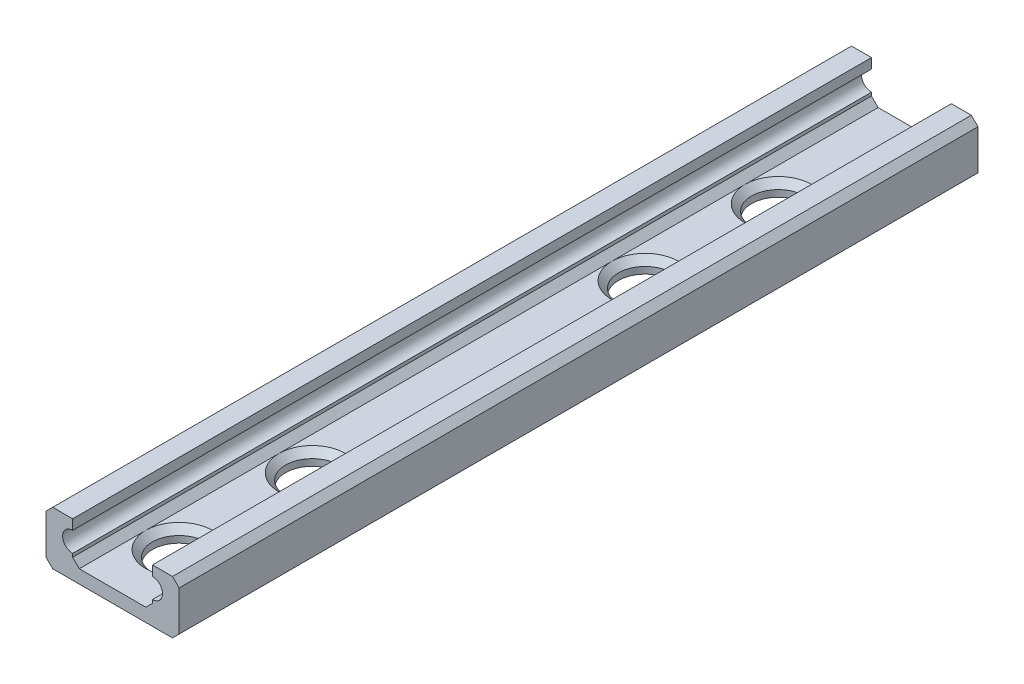
ISO-10303-21;
HEADER;
FILE_DESCRIPTION(('STEP AP214'),'2;1');
FILE_NAME('part.step','',(''),(''),'','','');
FILE_SCHEMA(('AUTOMOTIVE_DESIGN { 1 0 10303 214 1 1 1 1 }'));
ENDSEC;
DATA;
#1=APPLICATION_CONTEXT('core data for automotive mechanical design processes');
#2=APPLICATION_PROTOCOL_DEFINITION('international standard','automotive_design',2000,#1);
#3=PRODUCT_CONTEXT('',#1,'mechanical');
#4=PRODUCT('Part','Part','',(#3));
#5=PRODUCT_RELATED_PRODUCT_CATEGORY('part','',(#4));
#6=PRODUCT_DEFINITION_FORMATION('','',#4);
#7=PRODUCT_DEFINITION_CONTEXT('part definition',#1,'design');
#8=PRODUCT_DEFINITION('design','',#6,#7);
#9=PRODUCT_DEFINITION_SHAPE('','',#8);
#10=(LENGTH_UNIT() NAMED_UNIT(*) SI_UNIT(.MILLI.,.METRE.));
#11=(NAMED_UNIT(*) PLANE_ANGLE_UNIT() SI_UNIT($,.RADIAN.));
#12=(NAMED_UNIT(*) SI_UNIT($,.STERADIAN.) SOLID_ANGLE_UNIT());
#13=UNCERTAINTY_MEASURE_WITH_UNIT(LENGTH_MEASURE(1.E-05),#10,'distance_accuracy_value','');
#14=(GEOMETRIC_REPRESENTATION_CONTEXT(3) GLOBAL_UNCERTAINTY_ASSIGNED_CONTEXT((#13)) GLOBAL_UNIT_ASSIGNED_CONTEXT((#10,
#11,#12)) REPRESENTATION_CONTEXT('',''));
#15=CARTESIAN_POINT('',(0.,0.,0.));
#16=DIRECTION('',(0.,0.,1.));
#17=DIRECTION('',(1.,0.,0.));
#18=AXIS2_PLACEMENT_3D('',#15,#16,#17);
#19=CARTESIAN_POINT('',(0.,-1.,100.));
#20=DIRECTION('',(0.,-1.,0.));
#21=DIRECTION('',(0.,0.,-1.));
#22=AXIS2_PLACEMENT_3D('',#19,#20,#21);
#23=PLANE('',#22);
#24=DIRECTION('',(-1.,0.,0.));
#25=VECTOR('',#24,1.);
#26=CARTESIAN_POINT('',(0.,-1.,60.));
#27=LINE('',#26,#25);
#28=CARTESIAN_POINT('',(2.5,-1.,60.));
#29=VERTEX_POINT('',#28);
#30=CARTESIAN_POINT('',(-2.5,-1.,60.));
#31=VERTEX_POINT('',#30);
#32=EDGE_CURVE('E369',#29,#31,#27,.T.);
#33=ORIENTED_EDGE('',*,*,#32,.F.);
#34=DIRECTION('',(0.,0.,-1.));
#35=VECTOR('',#34,1.);
#36=CARTESIAN_POINT('',(2.5,-1.,100.));
#37=LINE('',#36,#35);
#38=CARTESIAN_POINT('',(2.5,-1.,55.));
#39=VERTEX_POINT('',#38);
#40=EDGE_CURVE('E320',#29,#39,#37,.T.);
#41=ORIENTED_EDGE('',*,*,#40,.T.);
#42=CARTESIAN_POINT('',(0.,-1.,55.));
#43=DIRECTION('',(0.,-1.,0.));
#44=DIRECTION('',(0.,0.,-1.));
#45=AXIS2_PLACEMENT_3D('',#42,#43,#44);
#46=CIRCLE('',#45,2.49999999999999);
#47=CARTESIAN_POINT('',(-2.5,-1.,55.));
#48=VERTEX_POINT('',#47);
#49=EDGE_CURVE('E58',#39,#48,#46,.T.);
#50=ORIENTED_EDGE('',*,*,#49,.T.);
#51=DIRECTION('',(0.,0.,1.));
#52=VECTOR('',#51,1.);
#53=CARTESIAN_POINT('',(-2.5,-1.,100.));
#54=LINE('',#53,#52);
#55=EDGE_CURVE('E300',#48,#31,#54,.T.);
#56=ORIENTED_EDGE('',*,*,#55,.T.);
#57=EDGE_LOOP('',(#33,#41,#50,#56));
#58=FACE_BOUND('',#57,.T.);
#59=ADVANCED_FACE('F36',(#58),#23,.F.);
#60=CARTESIAN_POINT('',(-3.,0.500000000000001,100.));
#61=DIRECTION('',(0.,0.,-1.));
#62=DIRECTION('',(-1.,0.,0.));
#63=AXIS2_PLACEMENT_3D('',#60,#61,#62);
#64=CYLINDRICAL_SURFACE('',#63,0.75);
#65=DIRECTION('',(0.,0.,-1.));
#66=VECTOR('',#65,1.);
#67=CARTESIAN_POINT('',(-3.,1.25,100.));
#68=LINE('',#67,#66);
#69=CARTESIAN_POINT('',(-3.,1.25,60.));
#70=VERTEX_POINT('',#69);
#71=CARTESIAN_POINT('',(-3.,1.25,0.));
#72=VERTEX_POINT('',#71);
#73=EDGE_CURVE('E318',#70,#72,#68,.T.);
#74=ORIENTED_EDGE('',*,*,#73,.F.);
#75=CARTESIAN_POINT('',(-3.,0.500000000000001,60.));
#76=DIRECTION('',(0.,0.,1.));
#77=DIRECTION('',(1.,0.,0.));
#78=AXIS2_PLACEMENT_3D('',#75,#76,#77);
#79=CIRCLE('',#78,0.75);
#80=CARTESIAN_POINT('',(-3.,-0.249999999999999,60.));
#81=VERTEX_POINT('',#80);
#82=EDGE_CURVE('E499',#70,#81,#79,.T.);
#83=ORIENTED_EDGE('',*,*,#82,.T.);
#84=DIRECTION('',(0.,0.,-1.));
#85=VECTOR('',#84,1.);
#86=CARTESIAN_POINT('',(-3.,-0.249999999999999,100.));
#87=LINE('',#86,#85);
#88=CARTESIAN_POINT('',(-3.,-0.249999999999999,0.));
#89=VERTEX_POINT('',#88);
#90=EDGE_CURVE('E424',#81,#89,#87,.T.);
#91=ORIENTED_EDGE('',*,*,#90,.T.);
#92=CARTESIAN_POINT('',(-3.,0.500000000000001,0.));
#93=DIRECTION('',(0.,0.,1.));
#94=DIRECTION('',(1.,0.,0.));
#95=AXIS2_PLACEMENT_3D('',#92,#93,#94);
#96=CIRCLE('',#95,0.75);
#97=EDGE_CURVE('E400',#72,#89,#96,.T.);
#98=ORIENTED_EDGE('',*,*,#97,.F.);
#99=EDGE_LOOP('',(#74,#83,#91,#98));
#100=FACE_BOUND('',#99,.T.);
#101=ADVANCED_FACE('F258',(#100),#64,.F.);
#102=CARTESIAN_POINT('',(-3.,0.,100.));
#103=DIRECTION('',(-1.,0.,0.));
#104=DIRECTION('',(0.,0.,1.));
#105=AXIS2_PLACEMENT_3D('',#102,#103,#104);
#106=PLANE('',#105);
#107=DIRECTION('',(0.,1.,0.));
#108=VECTOR('',#107,1.);
#109=CARTESIAN_POINT('',(-3.,0.,60.));
#110=LINE('',#109,#108);
#111=CARTESIAN_POINT('',(-3.,2.,60.));
#112=VERTEX_POINT('',#111);
#113=EDGE_CURVE('E500',#70,#112,#110,.T.);
#114=ORIENTED_EDGE('',*,*,#113,.F.);
#115=ORIENTED_EDGE('',*,*,#73,.T.);
#116=DIRECTION('',(0.,1.,0.));
#117=VECTOR('',#116,1.);
#118=CARTESIAN_POINT('',(-3.,0.,0.));
#119=LINE('',#118,#117);
#120=CARTESIAN_POINT('',(-3.,2.,0.));
#121=VERTEX_POINT('',#120);
#122=EDGE_CURVE('E403',#72,#121,#119,.T.);
#123=ORIENTED_EDGE('',*,*,#122,.T.);
#124=DIRECTION('',(0.,0.,-1.));
#125=VECTOR('',#124,1.);
#126=CARTESIAN_POINT('',(-3.,2.,100.));
#127=LINE('',#126,#125);
#128=EDGE_CURVE('E431',#112,#121,#127,.T.);
#129=ORIENTED_EDGE('',*,*,#128,.F.);
#130=EDGE_LOOP('',(#114,#115,#123,#129));
#131=FACE_BOUND('',#130,.T.);
#132=ADVANCED_FACE('F265',(#131),#106,.F.);
#133=CARTESIAN_POINT('',(0.,2.,100.));
#134=DIRECTION('',(0.,1.,0.));
#135=DIRECTION('',(0.,0.,1.));
#136=AXIS2_PLACEMENT_3D('',#133,#134,#135);
#137=PLANE('',#136);
#138=DIRECTION('',(0.,0.,1.));
#139=VECTOR('',#138,1.);
#140=CARTESIAN_POINT('',(-4.5,2.,100.));
#141=LINE('',#140,#139);
#142=CARTESIAN_POINT('',(-4.5,2.,0.));
#143=VERTEX_POINT('',#142);
#144=CARTESIAN_POINT('',(-4.5,2.,60.));
#145=VERTEX_POINT('',#144);
#146=EDGE_CURVE('E204',#143,#145,#141,.T.);
#147=ORIENTED_EDGE('',*,*,#146,.T.);
#148=DIRECTION('',(1.,0.,0.));
#149=VECTOR('',#148,1.);
#150=CARTESIAN_POINT('',(0.,2.,60.));
#151=LINE('',#150,#149);
#152=EDGE_CURVE('E51',#145,#112,#151,.T.);
#153=ORIENTED_EDGE('',*,*,#152,.T.);
#154=ORIENTED_EDGE('',*,*,#128,.T.);
#155=DIRECTION('',(1.,0.,0.));
#156=VECTOR('',#155,1.);
#157=CARTESIAN_POINT('',(0.,2.,0.));
#158=LINE('',#157,#156);
#159=EDGE_CURVE('E406',#143,#121,#158,.T.);
#160=ORIENTED_EDGE('',*,*,#159,.F.);
#161=EDGE_LOOP('',(#147,#153,#154,#160));
#162=FACE_BOUND('',#161,.T.);
#163=ADVANCED_FACE('F471',(#162),#137,.T.);
#164=CARTESIAN_POINT('',(-5.,0.,100.));
#165=DIRECTION('',(1.,0.,0.));
#166=DIRECTION('',(0.,0.,-1.));
#167=AXIS2_PLACEMENT_3D('',#164,#165,#166);
#168=PLANE('',#167);
#169=DIRECTION('',(0.,-1.,0.));
#170=VECTOR('',#169,1.);
#171=CARTESIAN_POINT('',(-5.,0.,60.));
#172=LINE('',#171,#170);
#173=CARTESIAN_POINT('',(-5.,1.5,60.));
#174=VERTEX_POINT('',#173);
#175=CARTESIAN_POINT('',(-5.,-1.5,60.));
#176=VERTEX_POINT('',#175);
#177=EDGE_CURVE('E184',#174,#176,#172,.T.);
#178=ORIENTED_EDGE('',*,*,#177,.F.);
#179=DIRECTION('',(0.,0.,-1.));
#180=VECTOR('',#179,1.);
#181=CARTESIAN_POINT('',(-5.,1.5,0.));
#182=LINE('',#181,#180);
#183=CARTESIAN_POINT('',(-5.,1.5,0.));
#184=VERTEX_POINT('',#183);
#185=EDGE_CURVE('E194',#174,#184,#182,.T.);
#186=ORIENTED_EDGE('',*,*,#185,.T.);
#187=DIRECTION('',(0.,-1.,0.));
#188=VECTOR('',#187,1.);
#189=CARTESIAN_POINT('',(-5.,0.,0.));
#190=LINE('',#189,#188);
#191=CARTESIAN_POINT('',(-5.,-1.5,0.));
#192=VERTEX_POINT('',#191);
#193=EDGE_CURVE('E410',#184,#192,#190,.T.);
#194=ORIENTED_EDGE('',*,*,#193,.T.);
#195=DIRECTION('',(0.,0.,1.));
#196=VECTOR('',#195,1.);
#197=CARTESIAN_POINT('',(-5.,-1.5,100.));
#198=LINE('',#197,#196);
#199=EDGE_CURVE('E197',#192,#176,#198,.T.);
#200=ORIENTED_EDGE('',*,*,#199,.T.);
#201=EDGE_LOOP('',(#178,#186,#194,#200));
#202=FACE_BOUND('',#201,.T.);
#203=ADVANCED_FACE('F192',(#202),#168,.F.);
#204=CARTESIAN_POINT('',(0.,-2.,100.));
#205=DIRECTION('',(0.,1.,0.));
#206=DIRECTION('',(0.,0.,1.));
#207=AXIS2_PLACEMENT_3D('',#204,#205,#206);
#208=PLANE('',#207);
#209=CARTESIAN_POINT('',(0.,-2.,20.));
#210=DIRECTION('',(0.,1.,0.));
#211=DIRECTION('',(0.,0.,1.));
#212=AXIS2_PLACEMENT_3D('',#209,#210,#211);
#213=CIRCLE('',#212,2.);
#214=CARTESIAN_POINT('',(0.,-2.,22.));
#215=VERTEX_POINT('',#214);
#216=EDGE_CURVE('E394',#215,#215,#213,.T.);
#217=ORIENTED_EDGE('',*,*,#216,.T.);
#218=EDGE_LOOP('',(#217));
#219=FACE_BOUND('',#218,.T.);
#220=CARTESIAN_POINT('',(0.,-2.,10.));
#221=DIRECTION('',(0.,1.,0.));
#222=DIRECTION('',(0.,0.,1.));
#223=AXIS2_PLACEMENT_3D('',#220,#221,#222);
#224=CIRCLE('',#223,2.);
#225=CARTESIAN_POINT('',(0.,-2.,12.));
#226=VERTEX_POINT('',#225);
#227=EDGE_CURVE('E397',#226,#226,#224,.T.);
#228=ORIENTED_EDGE('',*,*,#227,.T.);
#229=EDGE_LOOP('',(#228));
#230=FACE_BOUND('',#229,.T.);
#231=CARTESIAN_POINT('',(0.,-2.,55.));
#232=DIRECTION('',(0.,1.,0.));
#233=DIRECTION('',(0.,0.,1.));
#234=AXIS2_PLACEMENT_3D('',#231,#232,#233);
#235=CIRCLE('',#234,2.);
#236=CARTESIAN_POINT('',(0.,-2.,57.));
#237=VERTEX_POINT('',#236);
#238=EDGE_CURVE('E388',#237,#237,#235,.T.);
#239=ORIENTED_EDGE('',*,*,#238,.T.);
#240=EDGE_LOOP('',(#239));
#241=FACE_BOUND('',#240,.T.);
#242=CARTESIAN_POINT('',(0.,-2.,45.));
#243=DIRECTION('',(0.,1.,0.));
#244=DIRECTION('',(0.,0.,1.));
#245=AXIS2_PLACEMENT_3D('',#242,#243,#244);
#246=CIRCLE('',#245,2.);
#247=CARTESIAN_POINT('',(0.,-2.,47.));
#248=VERTEX_POINT('',#247);
#249=EDGE_CURVE('E391',#248,#248,#246,.T.);
#250=ORIENTED_EDGE('',*,*,#249,.T.);
#251=EDGE_LOOP('',(#250));
#252=FACE_BOUND('',#251,.T.);
#253=DIRECTION('',(1.,0.,0.));
#254=VECTOR('',#253,1.);
#255=CARTESIAN_POINT('',(0.,-2.,60.));
#256=LINE('',#255,#254);
#257=CARTESIAN_POINT('',(-4.5,-2.,60.));
#258=VERTEX_POINT('',#257);
#259=CARTESIAN_POINT('',(4.5,-2.,60.));
#260=VERTEX_POINT('',#259);
#261=EDGE_CURVE('E348',#258,#260,#256,.T.);
#262=ORIENTED_EDGE('',*,*,#261,.F.);
#263=DIRECTION('',(0.,0.,-1.));
#264=VECTOR('',#263,1.);
#265=CARTESIAN_POINT('',(-4.5,-2.,100.));
#266=LINE('',#265,#264);
#267=CARTESIAN_POINT('',(-4.5,-2.,0.));
#268=VERTEX_POINT('',#267);
#269=EDGE_CURVE('E341',#258,#268,#266,.T.);
#270=ORIENTED_EDGE('',*,*,#269,.T.);
#271=DIRECTION('',(1.,0.,0.));
#272=VECTOR('',#271,1.);
#273=CARTESIAN_POINT('',(0.,-2.,0.));
#274=LINE('',#273,#272);
#275=CARTESIAN_POINT('',(4.5,-2.,0.));
#276=VERTEX_POINT('',#275);
#277=EDGE_CURVE('E351',#268,#276,#274,.T.);
#278=ORIENTED_EDGE('',*,*,#277,.T.);
#279=DIRECTION('',(0.,0.,1.));
#280=VECTOR('',#279,1.);
#281=CARTESIAN_POINT('',(4.5,-2.,100.));
#282=LINE('',#281,#280);
#283=EDGE_CURVE('E206',#276,#260,#282,.T.);
#284=ORIENTED_EDGE('',*,*,#283,.T.);
#285=EDGE_LOOP('',(#262,#270,#278,#284));
#286=FACE_BOUND('',#285,.T.);
#287=ADVANCED_FACE('F347',(#219,#230,#241,#252,#286),#208,.F.);
#288=CARTESIAN_POINT('',(5.,0.,100.));
#289=DIRECTION('',(1.,0.,0.));
#290=DIRECTION('',(0.,0.,-1.));
#291=AXIS2_PLACEMENT_3D('',#288,#289,#290);
#292=PLANE('',#291);
#293=DIRECTION('',(0.,0.,1.));
#294=VECTOR('',#293,1.);
#295=CARTESIAN_POINT('',(5.,1.5,100.));
#296=LINE('',#295,#294);
#297=CARTESIAN_POINT('',(5.,1.5,0.));
#298=VERTEX_POINT('',#297);
#299=CARTESIAN_POINT('',(5.,1.5,60.));
#300=VERTEX_POINT('',#299);
#301=EDGE_CURVE('E329',#298,#300,#296,.T.);
#302=ORIENTED_EDGE('',*,*,#301,.T.);
#303=DIRECTION('',(0.,-1.,0.));
#304=VECTOR('',#303,1.);
#305=CARTESIAN_POINT('',(5.,0.,60.));
#306=LINE('',#305,#304);
#307=CARTESIAN_POINT('',(5.,-1.5,60.));
#308=VERTEX_POINT('',#307);
#309=EDGE_CURVE('E362',#300,#308,#306,.T.);
#310=ORIENTED_EDGE('',*,*,#309,.T.);
#311=DIRECTION('',(0.,0.,-1.));
#312=VECTOR('',#311,1.);
#313=CARTESIAN_POINT('',(5.,-1.5,0.));
#314=LINE('',#313,#312);
#315=CARTESIAN_POINT('',(5.,-1.5,0.));
#316=VERTEX_POINT('',#315);
#317=EDGE_CURVE('E332',#308,#316,#314,.T.);
#318=ORIENTED_EDGE('',*,*,#317,.T.);
#319=DIRECTION('',(0.,-1.,0.));
#320=VECTOR('',#319,1.);
#321=CARTESIAN_POINT('',(5.,0.,0.));
#322=LINE('',#321,#320);
#323=EDGE_CURVE('E414',#298,#316,#322,.T.);
#324=ORIENTED_EDGE('',*,*,#323,.F.);
#325=EDGE_LOOP('',(#302,#310,#318,#324));
#326=FACE_BOUND('',#325,.T.);
#327=ADVANCED_FACE('F454',(#326),#292,.T.);
#328=DIRECTION('',(0.,0.,-1.));
#329=VECTOR('',#328,1.);
#330=CARTESIAN_POINT('',(3.,2.,100.));
#331=LINE('',#330,#329);
#332=CARTESIAN_POINT('',(3.,2.,60.));
#333=VERTEX_POINT('',#332);
#334=CARTESIAN_POINT('',(3.,2.,0.));
#335=VERTEX_POINT('',#334);
#336=EDGE_CURVE('E430',#333,#335,#331,.T.);
#337=ORIENTED_EDGE('',*,*,#336,.F.);
#338=DIRECTION('',(1.,0.,0.));
#339=VECTOR('',#338,1.);
#340=CARTESIAN_POINT('',(0.,2.,60.));
#341=LINE('',#340,#339);
#342=CARTESIAN_POINT('',(4.5,2.,60.));
#343=VERTEX_POINT('',#342);
#344=EDGE_CURVE('E385',#333,#343,#341,.T.);
#345=ORIENTED_EDGE('',*,*,#344,.T.);
#346=DIRECTION('',(0.,0.,-1.));
#347=VECTOR('',#346,1.);
#348=CARTESIAN_POINT('',(4.5,2.,100.));
#349=LINE('',#348,#347);
#350=CARTESIAN_POINT('',(4.5,2.,0.));
#351=VERTEX_POINT('',#350);
#352=EDGE_CURVE('E202',#343,#351,#349,.T.);
#353=ORIENTED_EDGE('',*,*,#352,.T.);
#354=EDGE_CURVE('E411',#335,#351,#158,.T.);
#355=ORIENTED_EDGE('',*,*,#354,.F.);
#356=EDGE_LOOP('',(#337,#345,#353,#355));
#357=FACE_BOUND('',#356,.T.);
#358=ADVANCED_FACE('F477',(#357),#137,.T.);
#359=CARTESIAN_POINT('',(3.,0.,100.));
#360=DIRECTION('',(-1.,0.,0.));
#361=DIRECTION('',(0.,0.,1.));
#362=AXIS2_PLACEMENT_3D('',#359,#360,#361);
#363=PLANE('',#362);
#364=DIRECTION('',(0.,0.,-1.));
#365=VECTOR('',#364,1.);
#366=CARTESIAN_POINT('',(3.,1.25,100.));
#367=LINE('',#366,#365);
#368=CARTESIAN_POINT('',(3.,1.25,60.));
#369=VERTEX_POINT('',#368);
#370=CARTESIAN_POINT('',(3.,1.25,0.));
#371=VERTEX_POINT('',#370);
#372=EDGE_CURVE('E428',#369,#371,#367,.T.);
#373=ORIENTED_EDGE('',*,*,#372,.F.);
#374=DIRECTION('',(0.,1.,0.));
#375=VECTOR('',#374,1.);
#376=CARTESIAN_POINT('',(3.,0.,60.));
#377=LINE('',#376,#375);
#378=EDGE_CURVE('E382',#369,#333,#377,.T.);
#379=ORIENTED_EDGE('',*,*,#378,.T.);
#380=ORIENTED_EDGE('',*,*,#336,.T.);
#381=DIRECTION('',(0.,1.,0.));
#382=VECTOR('',#381,1.);
#383=CARTESIAN_POINT('',(3.,0.,0.));
#384=LINE('',#383,#382);
#385=EDGE_CURVE('E416',#371,#335,#384,.T.);
#386=ORIENTED_EDGE('',*,*,#385,.F.);
#387=EDGE_LOOP('',(#373,#379,#380,#386));
#388=FACE_BOUND('',#387,.T.);
#389=ADVANCED_FACE('F490',(#388),#363,.T.);
#390=CARTESIAN_POINT('',(3.,0.500000000000001,100.));
#391=DIRECTION('',(0.,0.,-1.));
#392=DIRECTION('',(-1.,0.,0.));
#393=AXIS2_PLACEMENT_3D('',#390,#391,#392);
#394=CYLINDRICAL_SURFACE('',#393,0.75);
#395=DIRECTION('',(0.,0.,-1.));
#396=VECTOR('',#395,1.);
#397=CARTESIAN_POINT('',(3.,-0.25,100.));
#398=LINE('',#397,#396);
#399=CARTESIAN_POINT('',(3.,-0.25,60.));
#400=VERTEX_POINT('',#399);
#401=CARTESIAN_POINT('',(3.,-0.25,0.));
#402=VERTEX_POINT('',#401);
#403=EDGE_CURVE('E426',#400,#402,#398,.T.);
#404=ORIENTED_EDGE('',*,*,#403,.F.);
#405=CARTESIAN_POINT('',(3.,0.500000000000001,60.));
#406=DIRECTION('',(0.,0.,1.));
#407=DIRECTION('',(1.,0.,0.));
#408=AXIS2_PLACEMENT_3D('',#405,#406,#407);
#409=CIRCLE('',#408,0.75);
#410=EDGE_CURVE('E379',#400,#369,#409,.T.);
#411=ORIENTED_EDGE('',*,*,#410,.T.);
#412=ORIENTED_EDGE('',*,*,#372,.T.);
#413=CARTESIAN_POINT('',(3.,0.500000000000001,0.));
#414=DIRECTION('',(0.,0.,1.));
#415=DIRECTION('',(1.,0.,0.));
#416=AXIS2_PLACEMENT_3D('',#413,#414,#415);
#417=CIRCLE('',#416,0.75);
#418=EDGE_CURVE('E419',#402,#371,#417,.T.);
#419=ORIENTED_EDGE('',*,*,#418,.F.);
#420=EDGE_LOOP('',(#404,#411,#412,#419));
#421=FACE_BOUND('',#420,.T.);
#422=ADVANCED_FACE('F488',(#421),#394,.F.);
#423=DIRECTION('',(0.,0.,1.));
#424=VECTOR('',#423,1.);
#425=CARTESIAN_POINT('',(3.,-0.499999999999999,100.));
#426=LINE('',#425,#424);
#427=CARTESIAN_POINT('',(3.,-0.499999999999999,0.));
#428=VERTEX_POINT('',#427);
#429=CARTESIAN_POINT('',(3.,-0.499999999999999,60.));
#430=VERTEX_POINT('',#429);
#431=EDGE_CURVE('E322',#428,#430,#426,.T.);
#432=ORIENTED_EDGE('',*,*,#431,.T.);
#433=DIRECTION('',(0.,1.,0.));
#434=VECTOR('',#433,1.);
#435=CARTESIAN_POINT('',(3.,0.,60.));
#436=LINE('',#435,#434);
#437=EDGE_CURVE('E376',#430,#400,#436,.T.);
#438=ORIENTED_EDGE('',*,*,#437,.T.);
#439=ORIENTED_EDGE('',*,*,#403,.T.);
#440=EDGE_CURVE('E420',#428,#402,#384,.T.);
#441=ORIENTED_EDGE('',*,*,#440,.F.);
#442=EDGE_LOOP('',(#432,#438,#439,#441));
#443=FACE_BOUND('',#442,.T.);
#444=ADVANCED_FACE('F480',(#443),#363,.T.);
#445=DIRECTION('',(0.,1.,0.));
#446=VECTOR('',#445,1.);
#447=CARTESIAN_POINT('',(-3.,0.,60.));
#448=LINE('',#447,#446);
#449=CARTESIAN_POINT('',(-3.,-0.499999999999999,60.));
#450=VERTEX_POINT('',#449);
#451=EDGE_CURVE('E364',#450,#81,#448,.T.);
#452=ORIENTED_EDGE('',*,*,#451,.F.);
#453=DIRECTION('',(0.,0.,-1.));
#454=VECTOR('',#453,1.);
#455=CARTESIAN_POINT('',(-3.,-0.499999999999999,0.));
#456=LINE('',#455,#454);
#457=CARTESIAN_POINT('',(-3.,-0.499999999999999,0.));
#458=VERTEX_POINT('',#457);
#459=EDGE_CURVE('E327',#450,#458,#456,.T.);
#460=ORIENTED_EDGE('',*,*,#459,.T.);
#461=EDGE_CURVE('E407',#458,#89,#119,.T.);
#462=ORIENTED_EDGE('',*,*,#461,.T.);
#463=ORIENTED_EDGE('',*,*,#90,.F.);
#464=EDGE_LOOP('',(#452,#460,#462,#463));
#465=FACE_BOUND('',#464,.T.);
#466=ADVANCED_FACE('F472',(#465),#106,.F.);
#467=CARTESIAN_POINT('',(2.5,-1.,100.));
#468=DIRECTION('',(0.707106781186547,-0.707106781186547,0.));
#469=DIRECTION('',(0.,0.,-1.));
#470=AXIS2_PLACEMENT_3D('',#467,#468,#469);
#471=PLANE('',#470);
#472=DIRECTION('',(-0.707106781186548,-0.707106781186548,0.));
#473=VECTOR('',#472,1.);
#474=CARTESIAN_POINT('',(2.5,-1.,60.));
#475=LINE('',#474,#473);
#476=EDGE_CURVE('E374',#430,#29,#475,.T.);
#477=ORIENTED_EDGE('',*,*,#476,.F.);
#478=ORIENTED_EDGE('',*,*,#431,.F.);
#479=DIRECTION('',(0.707106781186548,0.707106781186548,0.));
#480=VECTOR('',#479,1.);
#481=CARTESIAN_POINT('',(1.75,-1.75,0.));
#482=LINE('',#481,#480);
#483=CARTESIAN_POINT('',(2.5,-1.,0.));
#484=VERTEX_POINT('',#483);
#485=EDGE_CURVE('E211',#484,#428,#482,.T.);
#486=ORIENTED_EDGE('',*,*,#485,.F.);
#487=CARTESIAN_POINT('',(2.5,-1.,10.));
#488=VERTEX_POINT('',#487);
#489=EDGE_CURVE('E297',#488,#484,#37,.T.);
#490=ORIENTED_EDGE('',*,*,#489,.F.);
#491=CARTESIAN_POINT('',(2.5,-1.,20.));
#492=VERTEX_POINT('',#491);
#493=EDGE_CURVE('E308',#492,#488,#37,.T.);
#494=ORIENTED_EDGE('',*,*,#493,.F.);
#495=CARTESIAN_POINT('',(2.5,-1.,45.));
#496=VERTEX_POINT('',#495);
#497=EDGE_CURVE('E324',#496,#492,#37,.T.);
#498=ORIENTED_EDGE('',*,*,#497,.F.);
#499=EDGE_CURVE('E323',#39,#496,#37,.T.);
#500=ORIENTED_EDGE('',*,*,#499,.F.);
#501=ORIENTED_EDGE('',*,*,#40,.F.);
#502=EDGE_LOOP('',(#477,#478,#486,#490,#494,#498,#500,#501));
#503=FACE_BOUND('',#502,.T.);
#504=ADVANCED_FACE('F479',(#503),#471,.F.);
#505=CARTESIAN_POINT('',(-3.,-0.499999999999999,100.));
#506=DIRECTION('',(0.707106781186547,0.707106781186547,0.));
#507=DIRECTION('',(0.,0.,1.));
#508=AXIS2_PLACEMENT_3D('',#505,#506,#507);
#509=PLANE('',#508);
#510=DIRECTION('',(0.707106781186548,-0.707106781186548,0.));
#511=VECTOR('',#510,1.);
#512=CARTESIAN_POINT('',(-3.,-0.499999999999999,60.));
#513=LINE('',#512,#511);
#514=EDGE_CURVE('E360',#31,#450,#513,.F.);
#515=ORIENTED_EDGE('',*,*,#514,.F.);
#516=ORIENTED_EDGE('',*,*,#55,.F.);
#517=CARTESIAN_POINT('',(-2.5,-1.,45.));
#518=VERTEX_POINT('',#517);
#519=EDGE_CURVE('E315',#518,#48,#54,.T.);
#520=ORIENTED_EDGE('',*,*,#519,.F.);
#521=CARTESIAN_POINT('',(-2.5,-1.,20.));
#522=VERTEX_POINT('',#521);
#523=EDGE_CURVE('E314',#522,#518,#54,.T.);
#524=ORIENTED_EDGE('',*,*,#523,.F.);
#525=CARTESIAN_POINT('',(-2.5,-1.,10.));
#526=VERTEX_POINT('',#525);
#527=EDGE_CURVE('E298',#526,#522,#54,.T.);
#528=ORIENTED_EDGE('',*,*,#527,.F.);
#529=CARTESIAN_POINT('',(-2.5,-1.,0.));
#530=VERTEX_POINT('',#529);
#531=EDGE_CURVE('E289',#530,#526,#54,.T.);
#532=ORIENTED_EDGE('',*,*,#531,.F.);
#533=DIRECTION('',(-0.707106781186548,0.707106781186548,0.));
#534=VECTOR('',#533,1.);
#535=CARTESIAN_POINT('',(-1.75,-1.75,0.));
#536=LINE('',#535,#534);
#537=EDGE_CURVE('E213',#458,#530,#536,.F.);
#538=ORIENTED_EDGE('',*,*,#537,.F.);
#539=ORIENTED_EDGE('',*,*,#459,.F.);
#540=EDGE_LOOP('',(#515,#516,#520,#524,#528,#532,#538,#539));
#541=FACE_BOUND('',#540,.T.);
#542=ADVANCED_FACE('F311',(#541),#509,.T.);
#543=CARTESIAN_POINT('',(5.,-1.5,100.));
#544=DIRECTION('',(0.707106781186547,-0.707106781186547,0.));
#545=DIRECTION('',(0.,0.,1.));
#546=AXIS2_PLACEMENT_3D('',#543,#544,#545);
#547=PLANE('',#546);
#548=ORIENTED_EDGE('',*,*,#317,.F.);
#549=DIRECTION('',(-0.707106781186548,-0.707106781186548,0.));
#550=VECTOR('',#549,1.);
#551=CARTESIAN_POINT('',(5.,-1.5,60.));
#552=LINE('',#551,#550);
#553=EDGE_CURVE('E358',#308,#260,#552,.T.);
#554=ORIENTED_EDGE('',*,*,#553,.T.);
#555=ORIENTED_EDGE('',*,*,#283,.F.);
#556=DIRECTION('',(-0.707106781186548,-0.707106781186548,0.));
#557=VECTOR('',#556,1.);
#558=CARTESIAN_POINT('',(5.,-1.5,0.));
#559=LINE('',#558,#557);
#560=EDGE_CURVE('E339',#316,#276,#559,.T.);
#561=ORIENTED_EDGE('',*,*,#560,.F.);
#562=EDGE_LOOP('',(#548,#554,#555,#561));
#563=FACE_BOUND('',#562,.T.);
#564=ADVANCED_FACE('F356',(#563),#547,.T.);
#565=CARTESIAN_POINT('',(4.5,2.,100.));
#566=DIRECTION('',(-0.707106781186547,-0.707106781186547,0.));
#567=DIRECTION('',(0.,0.,-1.));
#568=AXIS2_PLACEMENT_3D('',#565,#566,#567);
#569=PLANE('',#568);
#570=ORIENTED_EDGE('',*,*,#352,.F.);
#571=DIRECTION('',(-0.707106781186548,0.707106781186548,0.));
#572=VECTOR('',#571,1.);
#573=CARTESIAN_POINT('',(4.5,2.,60.));
#574=LINE('',#573,#572);
#575=EDGE_CURVE('E371',#343,#300,#574,.F.);
#576=ORIENTED_EDGE('',*,*,#575,.T.);
#577=ORIENTED_EDGE('',*,*,#301,.F.);
#578=DIRECTION('',(-0.707106781186548,0.707106781186548,0.));
#579=VECTOR('',#578,1.);
#580=CARTESIAN_POINT('',(4.5,2.,0.));
#581=LINE('',#580,#579);
#582=EDGE_CURVE('E337',#351,#298,#581,.F.);
#583=ORIENTED_EDGE('',*,*,#582,.F.);
#584=EDGE_LOOP('',(#570,#576,#577,#583));
#585=FACE_BOUND('',#584,.T.);
#586=ADVANCED_FACE('F515',(#585),#569,.F.);
#587=CARTESIAN_POINT('',(-4.5,-2.,100.));
#588=DIRECTION('',(0.707106781186547,0.707106781186547,0.));
#589=DIRECTION('',(0.,0.,-1.));
#590=AXIS2_PLACEMENT_3D('',#587,#588,#589);
#591=PLANE('',#590);
#592=ORIENTED_EDGE('',*,*,#269,.F.);
#593=DIRECTION('',(0.707106781186548,-0.707106781186548,0.));
#594=VECTOR('',#593,1.);
#595=CARTESIAN_POINT('',(-4.5,-2.,60.));
#596=LINE('',#595,#594);
#597=EDGE_CURVE('E496',#258,#176,#596,.F.);
#598=ORIENTED_EDGE('',*,*,#597,.T.);
#599=ORIENTED_EDGE('',*,*,#199,.F.);
#600=DIRECTION('',(0.707106781186548,-0.707106781186548,0.));
#601=VECTOR('',#600,1.);
#602=CARTESIAN_POINT('',(-4.5,-2.,0.));
#603=LINE('',#602,#601);
#604=EDGE_CURVE('E335',#268,#192,#603,.F.);
#605=ORIENTED_EDGE('',*,*,#604,.F.);
#606=EDGE_LOOP('',(#592,#598,#599,#605));
#607=FACE_BOUND('',#606,.T.);
#608=ADVANCED_FACE('F507',(#607),#591,.F.);
#609=CARTESIAN_POINT('',(-5.,1.5,100.));
#610=DIRECTION('',(-0.707106781186547,0.707106781186547,0.));
#611=DIRECTION('',(0.,0.,1.));
#612=AXIS2_PLACEMENT_3D('',#609,#610,#611);
#613=PLANE('',#612);
#614=ORIENTED_EDGE('',*,*,#185,.F.);
#615=DIRECTION('',(0.707106781186548,0.707106781186548,0.));
#616=VECTOR('',#615,1.);
#617=CARTESIAN_POINT('',(-5.,1.5,60.));
#618=LINE('',#617,#616);
#619=EDGE_CURVE('E11',#174,#145,#618,.T.);
#620=ORIENTED_EDGE('',*,*,#619,.T.);
#621=ORIENTED_EDGE('',*,*,#146,.F.);
#622=DIRECTION('',(0.707106781186548,0.707106781186548,0.));
#623=VECTOR('',#622,1.);
#624=CARTESIAN_POINT('',(-5.,1.5,0.));
#625=LINE('',#624,#623);
#626=EDGE_CURVE('E200',#184,#143,#625,.T.);
#627=ORIENTED_EDGE('',*,*,#626,.F.);
#628=EDGE_LOOP('',(#614,#620,#621,#627));
#629=FACE_BOUND('',#628,.T.);
#630=ADVANCED_FACE('F199',(#629),#613,.T.);
#631=ORIENTED_EDGE('',*,*,#519,.T.);
#632=CARTESIAN_POINT('',(0.,-1.,55.));
#633=DIRECTION('',(0.,-1.,0.));
#634=DIRECTION('',(0.,0.,-1.));
#635=AXIS2_PLACEMENT_3D('',#632,#633,#634);
#636=CIRCLE('',#635,2.49999999999999);
#637=EDGE_CURVE('E240',#48,#39,#636,.T.);
#638=ORIENTED_EDGE('',*,*,#637,.T.);
#639=ORIENTED_EDGE('',*,*,#499,.T.);
#640=CARTESIAN_POINT('',(0.,-1.,45.));
#641=DIRECTION('',(0.,-1.,0.));
#642=DIRECTION('',(0.,0.,-1.));
#643=AXIS2_PLACEMENT_3D('',#640,#641,#642);
#644=CIRCLE('',#643,2.49999999999999);
#645=EDGE_CURVE('E234',#496,#518,#644,.T.);
#646=ORIENTED_EDGE('',*,*,#645,.T.);
#647=EDGE_LOOP('',(#631,#638,#639,#646));
#648=FACE_BOUND('',#647,.T.);
#649=ADVANCED_FACE('F260',(#648),#23,.F.);
#650=ORIENTED_EDGE('',*,*,#523,.T.);
#651=CARTESIAN_POINT('',(0.,-1.,45.));
#652=DIRECTION('',(0.,-1.,0.));
#653=DIRECTION('',(0.,0.,-1.));
#654=AXIS2_PLACEMENT_3D('',#651,#652,#653);
#655=CIRCLE('',#654,2.49999999999999);
#656=EDGE_CURVE('E236',#518,#496,#655,.T.);
#657=ORIENTED_EDGE('',*,*,#656,.T.);
#658=ORIENTED_EDGE('',*,*,#497,.T.);
#659=CARTESIAN_POINT('',(0.,-1.,20.));
#660=DIRECTION('',(0.,-1.,0.));
#661=DIRECTION('',(0.,0.,-1.));
#662=AXIS2_PLACEMENT_3D('',#659,#660,#661);
#663=CIRCLE('',#662,2.49999999999999);
#664=EDGE_CURVE('E223',#492,#522,#663,.T.);
#665=ORIENTED_EDGE('',*,*,#664,.T.);
#666=EDGE_LOOP('',(#650,#657,#658,#665));
#667=FACE_BOUND('',#666,.T.);
#668=ADVANCED_FACE('F272',(#667),#23,.F.);
#669=ORIENTED_EDGE('',*,*,#527,.T.);
#670=CARTESIAN_POINT('',(0.,-1.,20.));
#671=DIRECTION('',(0.,-1.,0.));
#672=DIRECTION('',(0.,0.,-1.));
#673=AXIS2_PLACEMENT_3D('',#670,#671,#672);
#674=CIRCLE('',#673,2.49999999999999);
#675=EDGE_CURVE('E225',#522,#492,#674,.T.);
#676=ORIENTED_EDGE('',*,*,#675,.T.);
#677=ORIENTED_EDGE('',*,*,#493,.T.);
#678=CARTESIAN_POINT('',(0.,-1.,10.));
#679=DIRECTION('',(0.,-1.,0.));
#680=DIRECTION('',(0.,0.,-1.));
#681=AXIS2_PLACEMENT_3D('',#678,#679,#680);
#682=CIRCLE('',#681,2.49999999999999);
#683=EDGE_CURVE('E218',#488,#526,#682,.T.);
#684=ORIENTED_EDGE('',*,*,#683,.T.);
#685=EDGE_LOOP('',(#669,#676,#677,#684));
#686=FACE_BOUND('',#685,.T.);
#687=ADVANCED_FACE('F276',(#686),#23,.F.);
#688=ORIENTED_EDGE('',*,*,#531,.T.);
#689=CARTESIAN_POINT('',(0.,-1.,10.));
#690=DIRECTION('',(0.,-1.,0.));
#691=DIRECTION('',(0.,0.,-1.));
#692=AXIS2_PLACEMENT_3D('',#689,#690,#691);
#693=CIRCLE('',#692,2.49999999999999);
#694=EDGE_CURVE('E220',#526,#488,#693,.T.);
#695=ORIENTED_EDGE('',*,*,#694,.T.);
#696=ORIENTED_EDGE('',*,*,#489,.T.);
#697=DIRECTION('',(-1.,0.,0.));
#698=VECTOR('',#697,1.);
#699=CARTESIAN_POINT('',(0.,-1.,0.));
#700=LINE('',#699,#698);
#701=EDGE_CURVE('E293',#484,#530,#700,.T.);
#702=ORIENTED_EDGE('',*,*,#701,.T.);
#703=EDGE_LOOP('',(#688,#695,#696,#702));
#704=FACE_BOUND('',#703,.T.);
#705=ADVANCED_FACE('F261',(#704),#23,.F.);
#706=CARTESIAN_POINT('',(0.,0.,0.));
#707=DIRECTION('',(0.,0.,1.));
#708=DIRECTION('',(1.,0.,0.));
#709=AXIS2_PLACEMENT_3D('',#706,#707,#708);
#710=PLANE('',#709);
#711=ORIENTED_EDGE('',*,*,#323,.T.);
#712=ORIENTED_EDGE('',*,*,#560,.T.);
#713=ORIENTED_EDGE('',*,*,#277,.F.);
#714=ORIENTED_EDGE('',*,*,#604,.T.);
#715=ORIENTED_EDGE('',*,*,#193,.F.);
#716=ORIENTED_EDGE('',*,*,#626,.T.);
#717=ORIENTED_EDGE('',*,*,#159,.T.);
#718=ORIENTED_EDGE('',*,*,#122,.F.);
#719=ORIENTED_EDGE('',*,*,#97,.T.);
#720=ORIENTED_EDGE('',*,*,#461,.F.);
#721=ORIENTED_EDGE('',*,*,#537,.T.);
#722=ORIENTED_EDGE('',*,*,#701,.F.);
#723=ORIENTED_EDGE('',*,*,#485,.T.);
#724=ORIENTED_EDGE('',*,*,#440,.T.);
#725=ORIENTED_EDGE('',*,*,#418,.T.);
#726=ORIENTED_EDGE('',*,*,#385,.T.);
#727=ORIENTED_EDGE('',*,*,#354,.T.);
#728=ORIENTED_EDGE('',*,*,#582,.T.);
#729=EDGE_LOOP('',(#711,#712,#713,#714,#715,#716,#717,#718,#719,#720,#721,#722,#723,#724,#725,
#726,#727,#728));
#730=FACE_BOUND('',#729,.T.);
#731=ADVANCED_FACE('F275',(#730),#710,.F.);
#732=CARTESIAN_POINT('',(0.,-201.,20.));
#733=DIRECTION('',(0.,1.,0.));
#734=DIRECTION('',(0.,0.,1.));
#735=AXIS2_PLACEMENT_3D('',#732,#733,#734);
#736=CYLINDRICAL_SURFACE('',#735,2.);
#737=CARTESIAN_POINT('',(0.,-1.5,20.));
#738=DIRECTION('',(0.,-1.,0.));
#739=DIRECTION('',(0.,0.,-1.));
#740=AXIS2_PLACEMENT_3D('',#737,#738,#739);
#741=CIRCLE('',#740,2.);
#742=CARTESIAN_POINT('',(0.,-1.5,18.));
#743=VERTEX_POINT('',#742);
#744=EDGE_CURVE('E215',#743,#743,#741,.F.);
#745=ORIENTED_EDGE('',*,*,#744,.T.);
#746=EDGE_LOOP('',(#745));
#747=FACE_BOUND('',#746,.T.);
#748=ORIENTED_EDGE('',*,*,#216,.F.);
#749=EDGE_LOOP('',(#748));
#750=FACE_BOUND('',#749,.T.);
#751=ADVANCED_FACE('F282',(#747,#750),#736,.F.);
#752=CARTESIAN_POINT('',(0.,-201.,10.));
#753=DIRECTION('',(0.,1.,0.));
#754=DIRECTION('',(0.,0.,1.));
#755=AXIS2_PLACEMENT_3D('',#752,#753,#754);
#756=CYLINDRICAL_SURFACE('',#755,2.);
#757=CARTESIAN_POINT('',(0.,-1.5,10.));
#758=DIRECTION('',(0.,-1.,0.));
#759=DIRECTION('',(0.,0.,-1.));
#760=AXIS2_PLACEMENT_3D('',#757,#758,#759);
#761=CIRCLE('',#760,2.);
#762=CARTESIAN_POINT('',(0.,-1.5,8.));
#763=VERTEX_POINT('',#762);
#764=EDGE_CURVE('E228',#763,#763,#761,.F.);
#765=ORIENTED_EDGE('',*,*,#764,.T.);
#766=EDGE_LOOP('',(#765));
#767=FACE_BOUND('',#766,.T.);
#768=ORIENTED_EDGE('',*,*,#227,.F.);
#769=EDGE_LOOP('',(#768));
#770=FACE_BOUND('',#769,.T.);
#771=ADVANCED_FACE('F463',(#767,#770),#756,.F.);
#772=CARTESIAN_POINT('',(0.,-1.5,20.));
#773=DIRECTION('',(0.,1.,0.));
#774=DIRECTION('',(0.,0.,1.));
#775=AXIS2_PLACEMENT_3D('',#772,#773,#774);
#776=CONICAL_SURFACE('',#775,2.,0.785398163397435);
#777=ORIENTED_EDGE('',*,*,#664,.F.);
#778=ORIENTED_EDGE('',*,*,#675,.F.);
#779=EDGE_LOOP('',(#777,#778));
#780=FACE_BOUND('',#779,.T.);
#781=ORIENTED_EDGE('',*,*,#744,.F.);
#782=EDGE_LOOP('',(#781));
#783=FACE_BOUND('',#782,.T.);
#784=ADVANCED_FACE('F466',(#780,#783),#776,.F.);
#785=CARTESIAN_POINT('',(0.,-1.5,10.));
#786=DIRECTION('',(0.,1.,0.));
#787=DIRECTION('',(0.,0.,1.));
#788=AXIS2_PLACEMENT_3D('',#785,#786,#787);
#789=CONICAL_SURFACE('',#788,2.,0.785398163397436);
#790=ORIENTED_EDGE('',*,*,#683,.F.);
#791=ORIENTED_EDGE('',*,*,#694,.F.);
#792=EDGE_LOOP('',(#790,#791));
#793=FACE_BOUND('',#792,.T.);
#794=ORIENTED_EDGE('',*,*,#764,.F.);
#795=EDGE_LOOP('',(#794));
#796=FACE_BOUND('',#795,.T.);
#797=ADVANCED_FACE('F302',(#793,#796),#789,.F.);
#798=CARTESIAN_POINT('',(0.,-201.,55.));
#799=DIRECTION('',(0.,1.,0.));
#800=DIRECTION('',(0.,0.,1.));
#801=AXIS2_PLACEMENT_3D('',#798,#799,#800);
#802=CYLINDRICAL_SURFACE('',#801,2.);
#803=CARTESIAN_POINT('',(0.,-1.5,55.));
#804=DIRECTION('',(0.,-1.,0.));
#805=DIRECTION('',(0.,0.,-1.));
#806=AXIS2_PLACEMENT_3D('',#803,#804,#805);
#807=CIRCLE('',#806,2.);
#808=CARTESIAN_POINT('',(0.,-1.5,53.));
#809=VERTEX_POINT('',#808);
#810=EDGE_CURVE('E231',#809,#809,#807,.F.);
#811=ORIENTED_EDGE('',*,*,#810,.T.);
#812=EDGE_LOOP('',(#811));
#813=FACE_BOUND('',#812,.T.);
#814=ORIENTED_EDGE('',*,*,#238,.F.);
#815=EDGE_LOOP('',(#814));
#816=FACE_BOUND('',#815,.T.);
#817=ADVANCED_FACE('F446',(#813,#816),#802,.F.);
#818=CARTESIAN_POINT('',(0.,-201.,45.));
#819=DIRECTION('',(0.,1.,0.));
#820=DIRECTION('',(0.,0.,1.));
#821=AXIS2_PLACEMENT_3D('',#818,#819,#820);
#822=CYLINDRICAL_SURFACE('',#821,2.);
#823=CARTESIAN_POINT('',(0.,-1.5,45.));
#824=DIRECTION('',(0.,-1.,0.));
#825=DIRECTION('',(0.,0.,-1.));
#826=AXIS2_PLACEMENT_3D('',#823,#824,#825);
#827=CIRCLE('',#826,2.);
#828=CARTESIAN_POINT('',(0.,-1.5,43.));
#829=VERTEX_POINT('',#828);
#830=EDGE_CURVE('E44',#829,#829,#827,.F.);
#831=ORIENTED_EDGE('',*,*,#830,.T.);
#832=EDGE_LOOP('',(#831));
#833=FACE_BOUND('',#832,.T.);
#834=ORIENTED_EDGE('',*,*,#249,.F.);
#835=EDGE_LOOP('',(#834));
#836=FACE_BOUND('',#835,.T.);
#837=ADVANCED_FACE('F245',(#833,#836),#822,.F.);
#838=CARTESIAN_POINT('',(0.,-1.5,55.));
#839=DIRECTION('',(0.,1.,0.));
#840=DIRECTION('',(0.,0.,1.));
#841=AXIS2_PLACEMENT_3D('',#838,#839,#840);
#842=CONICAL_SURFACE('',#841,2.,0.785398163397435);
#843=ORIENTED_EDGE('',*,*,#49,.F.);
#844=ORIENTED_EDGE('',*,*,#637,.F.);
#845=EDGE_LOOP('',(#843,#844));
#846=FACE_BOUND('',#845,.T.);
#847=ORIENTED_EDGE('',*,*,#810,.F.);
#848=EDGE_LOOP('',(#847));
#849=FACE_BOUND('',#848,.T.);
#850=ADVANCED_FACE('F249',(#846,#849),#842,.F.);
#851=CARTESIAN_POINT('',(0.,-1.5,45.));
#852=DIRECTION('',(0.,1.,0.));
#853=DIRECTION('',(0.,0.,1.));
#854=AXIS2_PLACEMENT_3D('',#851,#852,#853);
#855=CONICAL_SURFACE('',#854,2.,0.785398163397436);
#856=ORIENTED_EDGE('',*,*,#645,.F.);
#857=ORIENTED_EDGE('',*,*,#656,.F.);
#858=EDGE_LOOP('',(#856,#857));
#859=FACE_BOUND('',#858,.T.);
#860=ORIENTED_EDGE('',*,*,#830,.F.);
#861=EDGE_LOOP('',(#860));
#862=FACE_BOUND('',#861,.T.);
#863=ADVANCED_FACE('F38',(#859,#862),#855,.F.);
#864=CARTESIAN_POINT('',(7.50000000000001,10.,60.));
#865=DIRECTION('',(0.,0.,1.));
#866=DIRECTION('',(1.,0.,0.));
#867=AXIS2_PLACEMENT_3D('',#864,#865,#866);
#868=PLANE('',#867);
#869=ORIENTED_EDGE('',*,*,#378,.F.);
#870=ORIENTED_EDGE('',*,*,#410,.F.);
#871=ORIENTED_EDGE('',*,*,#437,.F.);
#872=ORIENTED_EDGE('',*,*,#476,.T.);
#873=ORIENTED_EDGE('',*,*,#32,.T.);
#874=ORIENTED_EDGE('',*,*,#514,.T.);
#875=ORIENTED_EDGE('',*,*,#451,.T.);
#876=ORIENTED_EDGE('',*,*,#82,.F.);
#877=ORIENTED_EDGE('',*,*,#113,.T.);
#878=ORIENTED_EDGE('',*,*,#152,.F.);
#879=ORIENTED_EDGE('',*,*,#619,.F.);
#880=ORIENTED_EDGE('',*,*,#177,.T.);
#881=ORIENTED_EDGE('',*,*,#597,.F.);
#882=ORIENTED_EDGE('',*,*,#261,.T.);
#883=ORIENTED_EDGE('',*,*,#553,.F.);
#884=ORIENTED_EDGE('',*,*,#309,.F.);
#885=ORIENTED_EDGE('',*,*,#575,.F.);
#886=ORIENTED_EDGE('',*,*,#344,.F.);
#887=EDGE_LOOP('',(#869,#870,#871,#872,#873,#874,#875,#876,#877,#878,#879,#880,#881,#882,#883,
#884,#885,#886));
#888=FACE_BOUND('',#887,.T.);
#889=ADVANCED_FACE('F183',(#888),#868,.T.);
#890=CLOSED_SHELL('',(#59,#101,#132,#163,#203,#287,#327,#358,#389,#422,#444,#466,#504,#542,#564,
#586,#608,#630,#649,#668,#687,#705,#731,#751,#771,#784,#797,#817,#837,#850,#863,#889));
#891=MANIFOLD_SOLID_BREP('B2',#890);
#892=ADVANCED_BREP_SHAPE_REPRESENTATION('',(#18,#891),#14);
#893=SHAPE_DEFINITION_REPRESENTATION(#9,#892);
ENDSEC;
END-ISO-10303-21;
